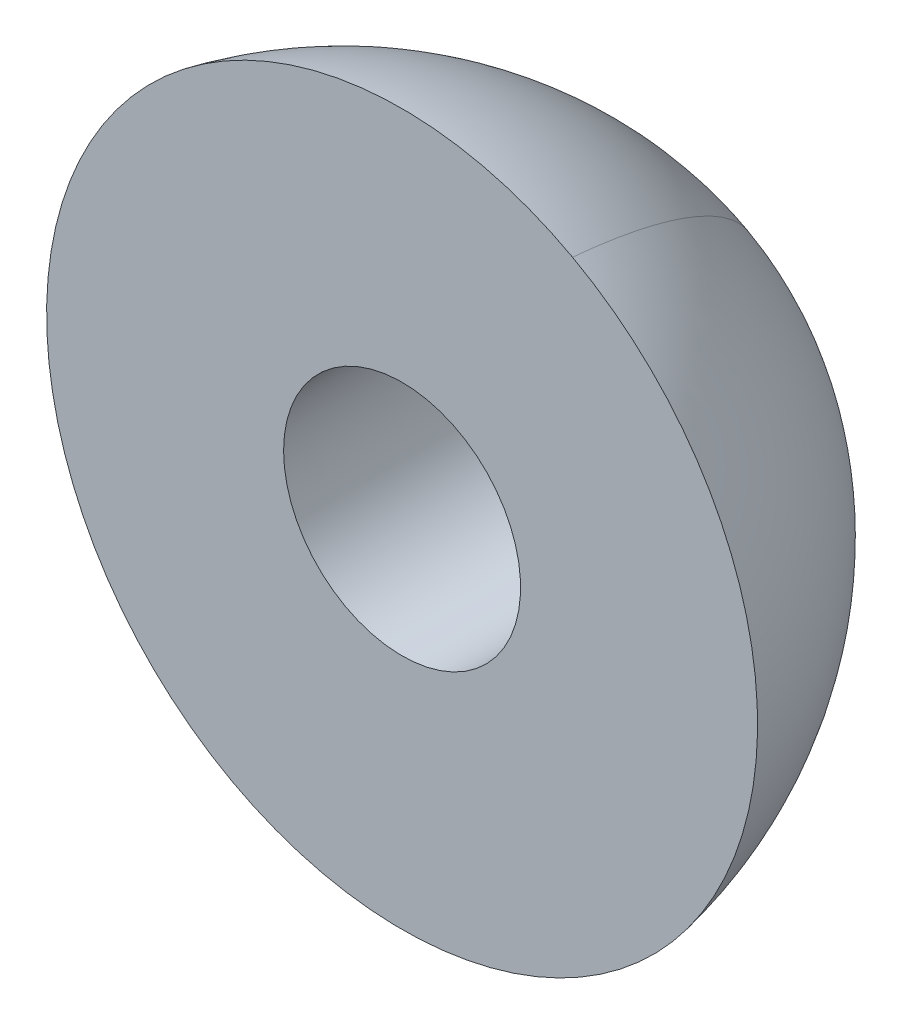
ISO-10303-21;
HEADER;
FILE_DESCRIPTION(('STEP AP214'),'2;1');
FILE_NAME('part.step','',(''),(''),'','','');
FILE_SCHEMA(('AUTOMOTIVE_DESIGN { 1 0 10303 214 1 1 1 1 }'));
ENDSEC;
DATA;
#1=APPLICATION_CONTEXT('core data for automotive mechanical design processes');
#2=APPLICATION_PROTOCOL_DEFINITION('international standard','automotive_design',2000,#1);
#3=PRODUCT_CONTEXT('',#1,'mechanical');
#4=PRODUCT('Part','Part','',(#3));
#5=PRODUCT_RELATED_PRODUCT_CATEGORY('part','',(#4));
#6=PRODUCT_DEFINITION_FORMATION('','',#4);
#7=PRODUCT_DEFINITION_CONTEXT('part definition',#1,'design');
#8=PRODUCT_DEFINITION('design','',#6,#7);
#9=PRODUCT_DEFINITION_SHAPE('','',#8);
#10=(LENGTH_UNIT() NAMED_UNIT(*) SI_UNIT(.MILLI.,.METRE.));
#11=(NAMED_UNIT(*) PLANE_ANGLE_UNIT() SI_UNIT($,.RADIAN.));
#12=(NAMED_UNIT(*) SI_UNIT($,.STERADIAN.) SOLID_ANGLE_UNIT());
#13=UNCERTAINTY_MEASURE_WITH_UNIT(LENGTH_MEASURE(1.E-05),#10,'distance_accuracy_value','');
#14=(GEOMETRIC_REPRESENTATION_CONTEXT(3) GLOBAL_UNCERTAINTY_ASSIGNED_CONTEXT((#13)) GLOBAL_UNIT_ASSIGNED_CONTEXT((#10,
#11,#12)) REPRESENTATION_CONTEXT('',''));
#15=CARTESIAN_POINT('',(0.,0.,0.));
#16=DIRECTION('',(0.,0.,1.));
#17=DIRECTION('',(1.,0.,0.));
#18=AXIS2_PLACEMENT_3D('',#15,#16,#17);
#19=CARTESIAN_POINT('',(10.4126553286348,-3.6734504658553,-7.02));
#20=CARTESIAN_POINT('',(10.2782051560537,-3.6,-7.02));
#21=CARTESIAN_POINT('',(10.125,-3.6,-7.02));
#22=CARTESIAN_POINT('',(9.525,-3.6,-7.02));
#23=CARTESIAN_POINT('',(9.525,-4.2,-7.02));
#24=CARTESIAN_POINT('',(9.525,-4.8,-7.02));
#25=CARTESIAN_POINT('',(10.125,-4.8,-7.02));
#26=CARTESIAN_POINT('',(10.725,-4.8,-7.02));
#27=CARTESIAN_POINT('',(10.725,-4.2,-7.02));
#28=CARTESIAN_POINT('',(10.725,-3.84408514172645,-7.02));
#29=CARTESIAN_POINT('',(10.4126553286348,-3.6734504658553,-7.02));
#30=CARTESIAN_POINT('',(10.3968421163721,-3.70239635602794,-7.18295627713));
#31=CARTESIAN_POINT('',(10.2697830431594,-3.63298366626,-7.18295627713));
#32=CARTESIAN_POINT('',(10.125,-3.63298366626,-7.18295627713));
#33=CARTESIAN_POINT('',(9.55798366626,-3.63298366626,-7.18295627713));
#34=CARTESIAN_POINT('',(9.55798366626,-4.2,-7.18295627713));
#35=CARTESIAN_POINT('',(9.55798366626,-4.76701633374,-7.18295627713));
#36=CARTESIAN_POINT('',(10.125,-4.76701633374,-7.18295627713));
#37=CARTESIAN_POINT('',(10.69201633374,-4.76701633374,-7.18295627713));
#38=CARTESIAN_POINT('',(10.69201633374,-4.2,-7.18295627713));
#39=CARTESIAN_POINT('',(10.69201633374,-3.8636507698969,-7.18295627713));
#40=CARTESIAN_POINT('',(10.3968421163721,-3.70239635602794,-7.18295627713));
#41=CARTESIAN_POINT('',(10.3561867072784,-3.7768155813569,-7.33577286233));
#42=CARTESIAN_POINT('',(10.2481299824489,-3.71778392208,-7.33577286233));
#43=CARTESIAN_POINT('',(10.125,-3.71778392208,-7.33577286233));
#44=CARTESIAN_POINT('',(9.64278392208,-3.71778392208,-7.33577286233));
#45=CARTESIAN_POINT('',(9.64278392208,-4.2,-7.33577286233));
#46=CARTESIAN_POINT('',(9.64278392208,-4.68221607792,-7.33577286233));
#47=CARTESIAN_POINT('',(10.125,-4.68221607792,-7.33577286233));
#48=CARTESIAN_POINT('',(10.60721607792,-4.68221607792,-7.33577286233));
#49=CARTESIAN_POINT('',(10.60721607792,-4.2,-7.33577286233));
#50=CARTESIAN_POINT('',(10.60721607792,-3.91395355494979,-7.33577286233));
#51=CARTESIAN_POINT('',(10.3561867072784,-3.7768155813569,-7.33577286233));
#52=CARTESIAN_POINT('',(10.2936338214068,-3.89131786807427,-7.45204992331));
#53=CARTESIAN_POINT('',(10.2148143310857,-3.8482585832,-7.45204992331));
#54=CARTESIAN_POINT('',(10.125,-3.8482585832,-7.45204992331));
#55=CARTESIAN_POINT('',(9.7732585832,-3.8482585832,-7.45204992331));
#56=CARTESIAN_POINT('',(9.7732585832,-4.2,-7.45204992331));
#57=CARTESIAN_POINT('',(9.7732585832,-4.5517414168,-7.45204992331));
#58=CARTESIAN_POINT('',(10.125,-4.5517414168,-7.45204992331));
#59=CARTESIAN_POINT('',(10.4767414168,-4.5517414168,-7.45204992331));
#60=CARTESIAN_POINT('',(10.4767414168,-4.2,-7.45204992331));
#61=CARTESIAN_POINT('',(10.4767414168,-3.99135000581782,-7.45204992331));
#62=CARTESIAN_POINT('',(10.2936338214068,-3.89131786807427,-7.45204992331));
#63=CARTESIAN_POINT('',(10.2208851095449,-4.02448348861843,-7.52));
#64=CARTESIAN_POINT('',(10.1760683853512,-4.,-7.52));
#65=CARTESIAN_POINT('',(10.125,-4.,-7.52));
#66=CARTESIAN_POINT('',(9.925,-4.,-7.52));
#67=CARTESIAN_POINT('',(9.925,-4.2,-7.52));
#68=CARTESIAN_POINT('',(9.925,-4.4,-7.52));
#69=CARTESIAN_POINT('',(10.125,-4.4,-7.52));
#70=CARTESIAN_POINT('',(10.325,-4.4,-7.52));
#71=CARTESIAN_POINT('',(10.325,-4.2,-7.52));
#72=CARTESIAN_POINT('',(10.325,-4.08136171390882,-7.52));
#73=CARTESIAN_POINT('',(10.2208851095449,-4.02448348861843,-7.52));
#74=(BOUNDED_SURFACE() B_SPLINE_SURFACE(4,2,((#19,#20,#21,#22,#23,#24,#25,#26,#27,#28,#29),(#30,
#31,#32,#33,#34,#35,#36,#37,#38,#39,#40),(#41,#42,#43,#44,#45,#46,#47,#48,#49,#50,#51),(#52,#53,
#54,#55,#56,#57,#58,#59,#60,#61,#62),(#63,#64,#65,#66,#67,#68,#69,#70,#71,#72,#73)),
.UNSPECIFIED.,.F.,.T.,.F.) B_SPLINE_SURFACE_WITH_KNOTS((5,5),(3,2,2,2,2,3),(3.59338935395,
4.25843275699),(5.77021321436567,6.28318530717959,7.85398163397448,9.42477796076938,
10.9955742875643,12.0533985215453),
.UNSPECIFIED.) GEOMETRIC_REPRESENTATION_ITEM() RATIONAL_B_SPLINE_SURFACE(((0.871173024921435,
0.904350395488696,1.,0.707106781186548,1.,0.707106781186548,1.,0.707106781186548,1.,
0.802756385697852,0.871173024921435),(0.871173024921435,0.904350395488696,1.,0.707106781186548,
1.,0.707106781186548,1.,0.707106781186548,1.,0.802756385697852,0.871173024921435),
(0.871173024921435,0.904350395488696,1.,0.707106781186548,1.,0.707106781186548,1.,
0.707106781186548,1.,0.802756385697852,0.871173024921435),(0.871173024921435,0.904350395488696,
1.,0.707106781186548,1.,0.707106781186548,1.,0.707106781186548,1.,0.802756385697852,
0.871173024921435),(0.871173024921435,0.904350395488696,1.,0.707106781186548,1.,
0.707106781186548,1.,0.707106781186548,1.,0.802756385697852,0.871173024921435))) REPRESENTATION_ITEM('') SURFACE());
#75=CARTESIAN_POINT('',(10.125,-4.20000000000004,-7.02));
#76=DIRECTION('',(0.,0.,1.));
#77=DIRECTION('',(0.,-1.,0.));
#78=AXIS2_PLACEMENT_3D('',#75,#76,#77);
#79=CIRCLE('',#78,0.600000000000035);
#80=CARTESIAN_POINT('',(10.4126553249935,-3.67345046386605,-7.02));
#81=VERTEX_POINT('',#80);
#82=CARTESIAN_POINT('',(9.83734467686956,-4.72654953715179,-7.02));
#83=VERTEX_POINT('',#82);
#84=EDGE_CURVE('E53',#81,#83,#79,.T.);
#85=CARTESIAN_POINT('',(10.4126553286348,-3.6734504658553,-7.02));
#86=CARTESIAN_POINT('',(10.4126546714423,-3.67345166883811,-7.02000677241555));
#87=CARTESIAN_POINT('',(10.4126540142016,-3.67345287190903,-7.02001354481014));
#88=CARTESIAN_POINT('',(10.4126515357505,-3.67345740868335,-7.0200390815261));
#89=CARTESIAN_POINT('',(10.4126497142183,-3.67346074297559,-7.02005784571004));
#90=CARTESIAN_POINT('',(10.4113540444705,-3.67583245048016,-7.03340212923775));
#91=CARTESIAN_POINT('',(10.4098731480153,-3.67854321318971,-7.046652079446));
#92=CARTESIAN_POINT('',(10.4065963993501,-3.68454126123696,-7.07253348135453));
#93=CARTESIAN_POINT('',(10.4048119341682,-3.68780770276002,-7.0851712703465));
#94=CARTESIAN_POINT('',(10.4009681017861,-3.69484379056307,-7.10980801437561));
#95=CARTESIAN_POINT('',(10.3989196245227,-3.69859350294789,-7.12181434939736));
#96=CARTESIAN_POINT('',(10.3945866128719,-3.70652502737428,-7.14517353203786));
#97=CARTESIAN_POINT('',(10.3923124262105,-3.7106878980308,-7.15653473881593));
#98=CARTESIAN_POINT('',(10.3875628712888,-3.71938189978167,-7.17860772478805));
#99=CARTESIAN_POINT('',(10.3850970343758,-3.72389558386218,-7.18932842911336));
#100=CARTESIAN_POINT('',(10.3800014690533,-3.73322295338798,-7.21010876035014));
#101=CARTESIAN_POINT('',(10.3773809768876,-3.73801973200281,-7.22017824477182));
#102=CARTESIAN_POINT('',(10.3720096612669,-3.74785185905168,-7.23966193501533));
#103=CARTESIAN_POINT('',(10.3692674945066,-3.7528713615126,-7.24908652721603));
#104=CARTESIAN_POINT('',(10.3636844419004,-3.76309107050444,-7.26729107995362));
#105=CARTESIAN_POINT('',(10.3608516383713,-3.76827648245381,-7.27608182820511));
#106=CARTESIAN_POINT('',(10.3551169381508,-3.77877378053503,-7.29303343967462));
#107=CARTESIAN_POINT('',(10.3522225605524,-3.78407190305976,-7.30120537326532));
#108=CARTESIAN_POINT('',(10.3463923406333,-3.79474404877239,-7.31693749622664));
#109=CARTESIAN_POINT('',(10.3434634697971,-3.80010531074391,-7.32450892954108));
#110=CARTESIAN_POINT('',(10.3375899036053,-3.81085680127484,-7.33906094951341));
#111=CARTESIAN_POINT('',(10.3346516510592,-3.81623523635095,-7.34605285358377));
#112=CARTESIAN_POINT('',(10.3287830036748,-3.82697772306581,-7.35946888546512));
#113=CARTESIAN_POINT('',(10.3258585441619,-3.8323309101646,-7.365904312711));
#114=CARTESIAN_POINT('',(10.3200392466285,-3.84298306258558,-7.37823211437944));
#115=CARTESIAN_POINT('',(10.3171498594493,-3.84827205020985,-7.38413568643226));
#116=CARTESIAN_POINT('',(10.311420629299,-3.85875933539622,-7.39542565037652));
#117=CARTESIAN_POINT('',(10.3085857757249,-3.8639484999285,-7.40082306296864));
#118=CARTESIAN_POINT('',(10.3029836999076,-3.87420303067542,-7.41112739067044));
#119=CARTESIAN_POINT('',(10.3002210324558,-3.87926005940045,-7.41604507659294));
#120=CARTESIAN_POINT('',(10.2947798822297,-3.88922001783596,-7.42541674066087));
#121=CARTESIAN_POINT('',(10.292105534539,-3.89411537832684,-7.42988119022375));
#122=CARTESIAN_POINT('',(10.2844754708097,-3.90808211595525,-7.4422237993007));
#123=CARTESIAN_POINT('',(10.2794452124535,-3.9172899418869,-7.44990311531928));
#124=CARTESIAN_POINT('',(10.2698682024363,-3.93482054070285,-7.46368693864904));
#125=CARTESIAN_POINT('',(10.2653457635717,-3.94309880931321,-7.46986525290199));
#126=CARTESIAN_POINT('',(10.2568654757556,-3.95862187165582,-7.48084990238066));
#127=CARTESIAN_POINT('',(10.2529270702572,-3.96583107438646,-7.48572154758932));
#128=CARTESIAN_POINT('',(10.2456780953182,-3.97910023368186,-7.49427518507073));
#129=CARTESIAN_POINT('',(10.2423826384503,-3.9851325268683,-7.49801310225865));
#130=CARTESIAN_POINT('',(10.234608225735,-3.99936349353771,-7.50648204166408));
#131=CARTESIAN_POINT('',(10.2301060966111,-4.00760458541722,-7.51112116544221));
#132=CARTESIAN_POINT('',(10.2240049166131,-4.01877272022214,-7.51705596370181));
#133=CARTESIAN_POINT('',(10.2224476620196,-4.02162325556676,-7.51854052958648));
#134=CARTESIAN_POINT('',(10.2208851095449,-4.02448348861843,-7.52));
#135=B_SPLINE_CURVE_WITH_KNOTS('',3,(#85,#86,#87,#88,#89,#90,#91,#92,#93,#94,#95,#96,#97,#98,
#99,#100,#101,#102,#103,#104,#105,#106,#107,#108,#109,#110,#111,#112,#113,#114,#115,#116,#117,
#118,#119,#120,#121,#122,#123,#124,#125,#126,#127,#128,#129,#130,#131,#132,#133,#134),
.UNSPECIFIED.,.F.,.F.,(4,2,2,2,2,2,2,2,2,2,2,2,2,2,2,2,2,2,2,2,2,2,2,2,4),(0.,
2.07292565339587E-05,7.81641911860983E-05,0.0408663197291154,0.0803699978280657,
0.118582659256838,0.155500802421267,0.19115728109239,0.225515504908005,0.258576462533591,
0.290341556495688,0.320812275897041,0.349989976833831,0.377875751856306,0.404470369623662,
0.429774266939325,0.453787577189301,0.476510181500029,0.497941771413769,0.536926346243527,
0.570742485200193,0.599386408902901,0.622855679269584,0.654265717165696,0.664979279515406),.UNSPECIFIED.);
#136=CARTESIAN_POINT('',(10.2208851081642,-4.02448348786415,-7.52));
#137=VERTEX_POINT('',#136);
#138=EDGE_CURVE('E42',#81,#137,#135,.T.);
#139=CARTESIAN_POINT('',(10.125,-4.20000000000002,-7.52));
#140=DIRECTION('',(0.,0.,-1.));
#141=DIRECTION('',(-1.,0.,0.));
#142=AXIS2_PLACEMENT_3D('',#139,#140,#141);
#143=CIRCLE('',#142,0.2);
#144=CARTESIAN_POINT('',(10.0291148922876,-4.37551651238268,-7.52));
#145=VERTEX_POINT('',#144);
#146=EDGE_CURVE('E51',#145,#137,#143,.T.);
#147=CARTESIAN_POINT('',(9.83734467688806,-4.72654953716186,-7.02));
#148=CARTESIAN_POINT('',(9.85315788884712,-4.69760364682335,-7.18295627713));
#149=CARTESIAN_POINT('',(9.89381329716025,-4.62318442106797,-7.33577286233));
#150=CARTESIAN_POINT('',(9.95636618183091,-4.50868213369449,-7.45204992331));
#151=CARTESIAN_POINT('',(10.029114892296,-4.37551651238729,-7.52));
#152=B_SPLINE_CURVE_WITH_KNOTS('',4,(#147,#148,#149,#150,#151),.UNSPECIFIED.,.F.,.F.,(5,5),
(3.59338935395,4.25843275699),.UNSPECIFIED.);
#153=EDGE_CURVE('E35',#145,#83,#152,.F.);
#154=ORIENTED_EDGE('',*,*,#84,.F.);
#155=ORIENTED_EDGE('',*,*,#138,.T.);
#156=ORIENTED_EDGE('',*,*,#146,.F.);
#157=ORIENTED_EDGE('',*,*,#153,.T.);
#158=EDGE_LOOP('',(#154,#155,#156,#157));
#159=FACE_BOUND('',#158,.T.);
#160=ADVANCED_FACE('F17',(#159),#74,.T.);
#161=CARTESIAN_POINT('',(10.125,-4.20000000000002,-7.02));
#162=DIRECTION('',(0.,0.,-1.));
#163=DIRECTION('',(-1.,0.,0.));
#164=AXIS2_PLACEMENT_3D('',#161,#162,#163);
#165=CYLINDRICAL_SURFACE('',#164,0.2);
#166=CARTESIAN_POINT('',(10.125,-4.2,-7.52));
#167=DIRECTION('',(0.,0.,1.));
#168=DIRECTION('',(1.,0.,0.));
#169=AXIS2_PLACEMENT_3D('',#166,#167,#168);
#170=CIRCLE('',#169,0.2);
#171=EDGE_CURVE('E27',#145,#137,#170,.T.);
#172=ORIENTED_EDGE('',*,*,#171,.F.);
#173=ORIENTED_EDGE('',*,*,#146,.T.);
#174=EDGE_LOOP('',(#172,#173));
#175=FACE_BOUND('',#174,.T.);
#176=CARTESIAN_POINT('',(10.125,-4.20000000000002,-7.02));
#177=DIRECTION('',(0.,0.,-1.));
#178=DIRECTION('',(-1.,0.,0.));
#179=AXIS2_PLACEMENT_3D('',#176,#177,#178);
#180=CIRCLE('',#179,0.2);
#181=CARTESIAN_POINT('',(9.92500000000002,-4.20000000000002,-7.02));
#182=VERTEX_POINT('',#181);
#183=EDGE_CURVE('E57',#182,#182,#180,.T.);
#184=ORIENTED_EDGE('',*,*,#183,.F.);
#185=EDGE_LOOP('',(#184));
#186=FACE_BOUND('',#185,.T.);
#187=ADVANCED_FACE('F55',(#175,#186),#165,.F.);
#188=CARTESIAN_POINT('',(10.9402048602931,-3.38479513967979,-7.02));
#189=DIRECTION('',(0.,0.,1.));
#190=DIRECTION('',(-1.,0.,0.));
#191=AXIS2_PLACEMENT_3D('',#188,#189,#190);
#192=PLANE('',#191);
#193=ORIENTED_EDGE('',*,*,#183,.T.);
#194=EDGE_LOOP('',(#193));
#195=FACE_BOUND('',#194,.T.);
#196=CARTESIAN_POINT('',(10.125,-4.2,-7.02));
#197=DIRECTION('',(0.,0.,1.));
#198=DIRECTION('',(1.,0.,0.));
#199=AXIS2_PLACEMENT_3D('',#196,#197,#198);
#200=CIRCLE('',#199,0.6);
#201=EDGE_CURVE('E11',#81,#83,#200,.F.);
#202=ORIENTED_EDGE('',*,*,#201,.F.);
#203=ORIENTED_EDGE('',*,*,#84,.T.);
#204=EDGE_LOOP('',(#202,#203));
#205=FACE_BOUND('',#204,.T.);
#206=ADVANCED_FACE('F19',(#195,#205),#192,.T.);
#207=CARTESIAN_POINT('',(10.125,-3.6,-7.02));
#208=CARTESIAN_POINT('',(9.525,-3.6,-7.02));
#209=CARTESIAN_POINT('',(9.525,-4.2,-7.02));
#210=CARTESIAN_POINT('',(9.525,-4.8,-7.02));
#211=CARTESIAN_POINT('',(10.125,-4.8,-7.02));
#212=CARTESIAN_POINT('',(10.725,-4.8,-7.02));
#213=CARTESIAN_POINT('',(10.725,-4.2,-7.02));
#214=CARTESIAN_POINT('',(10.725,-3.6,-7.02));
#215=CARTESIAN_POINT('',(10.125,-3.6,-7.02));
#216=CARTESIAN_POINT('',(10.125,-3.63298366626,-7.18295627713));
#217=CARTESIAN_POINT('',(9.55798366626,-3.63298366626,-7.18295627713));
#218=CARTESIAN_POINT('',(9.55798366626,-4.2,-7.18295627713));
#219=CARTESIAN_POINT('',(9.55798366626,-4.76701633374,-7.18295627713));
#220=CARTESIAN_POINT('',(10.125,-4.76701633374,-7.18295627713));
#221=CARTESIAN_POINT('',(10.69201633374,-4.76701633374,-7.18295627713));
#222=CARTESIAN_POINT('',(10.69201633374,-4.2,-7.18295627713));
#223=CARTESIAN_POINT('',(10.69201633374,-3.63298366626,-7.18295627713));
#224=CARTESIAN_POINT('',(10.125,-3.63298366626,-7.18295627713));
#225=CARTESIAN_POINT('',(10.125,-3.71778392208,-7.33577286233));
#226=CARTESIAN_POINT('',(9.64278392208,-3.71778392208,-7.33577286233));
#227=CARTESIAN_POINT('',(9.64278392208,-4.2,-7.33577286233));
#228=CARTESIAN_POINT('',(9.64278392208,-4.68221607792,-7.33577286233));
#229=CARTESIAN_POINT('',(10.125,-4.68221607792,-7.33577286233));
#230=CARTESIAN_POINT('',(10.60721607792,-4.68221607792,-7.33577286233));
#231=CARTESIAN_POINT('',(10.60721607792,-4.2,-7.33577286233));
#232=CARTESIAN_POINT('',(10.60721607792,-3.71778392208,-7.33577286233));
#233=CARTESIAN_POINT('',(10.125,-3.71778392208,-7.33577286233));
#234=CARTESIAN_POINT('',(10.125,-3.8482585832,-7.45204992331));
#235=CARTESIAN_POINT('',(9.7732585832,-3.8482585832,-7.45204992331));
#236=CARTESIAN_POINT('',(9.7732585832,-4.2,-7.45204992331));
#237=CARTESIAN_POINT('',(9.7732585832,-4.5517414168,-7.45204992331));
#238=CARTESIAN_POINT('',(10.125,-4.5517414168,-7.45204992331));
#239=CARTESIAN_POINT('',(10.4767414168,-4.5517414168,-7.45204992331));
#240=CARTESIAN_POINT('',(10.4767414168,-4.2,-7.45204992331));
#241=CARTESIAN_POINT('',(10.4767414168,-3.8482585832,-7.45204992331));
#242=CARTESIAN_POINT('',(10.125,-3.8482585832,-7.45204992331));
#243=CARTESIAN_POINT('',(10.125,-4.,-7.52));
#244=CARTESIAN_POINT('',(9.925,-4.,-7.52));
#245=CARTESIAN_POINT('',(9.925,-4.2,-7.52));
#246=CARTESIAN_POINT('',(9.925,-4.4,-7.52));
#247=CARTESIAN_POINT('',(10.125,-4.4,-7.52));
#248=CARTESIAN_POINT('',(10.325,-4.4,-7.52));
#249=CARTESIAN_POINT('',(10.325,-4.2,-7.52));
#250=CARTESIAN_POINT('',(10.325,-4.,-7.52));
#251=CARTESIAN_POINT('',(10.125,-4.,-7.52));
#252=(BOUNDED_SURFACE() B_SPLINE_SURFACE(4,2,((#207,#208,#209,#210,#211,#212,#213,#214,#215),
(#216,#217,#218,#219,#220,#221,#222,#223,#224),(#225,#226,#227,#228,#229,#230,#231,#232,#233),
(#234,#235,#236,#237,#238,#239,#240,#241,#242),(#243,#244,#245,#246,#247,#248,#249,#250,#251)),
.UNSPECIFIED.,.F.,.T.,.F.) B_SPLINE_SURFACE_WITH_KNOTS((5,5),(3,2,2,2,3),(3.59338935395,
4.25843275699),(0.,1.5707963267949,3.14159265358979,4.71238898038469,6.28318530717959),
.UNSPECIFIED.) GEOMETRIC_REPRESENTATION_ITEM() RATIONAL_B_SPLINE_SURFACE(((1.,0.707106781186548,
1.,0.707106781186548,1.,0.707106781186548,1.,0.707106781186548,1.),(1.,0.707106781186548,1.,
0.707106781186548,1.,0.707106781186548,1.,0.707106781186548,1.),(1.,0.707106781186548,1.,
0.707106781186548,1.,0.707106781186548,1.,0.707106781186548,1.),(1.,0.707106781186548,1.,
0.707106781186548,1.,0.707106781186548,1.,0.707106781186548,1.),(1.,0.707106781186548,1.,
0.707106781186548,1.,0.707106781186548,1.,0.707106781186548,1.))) REPRESENTATION_ITEM('') SURFACE());
#253=ORIENTED_EDGE('',*,*,#201,.T.);
#254=ORIENTED_EDGE('',*,*,#153,.F.);
#255=ORIENTED_EDGE('',*,*,#171,.T.);
#256=ORIENTED_EDGE('',*,*,#138,.F.);
#257=EDGE_LOOP('',(#253,#254,#255,#256));
#258=FACE_BOUND('',#257,.T.);
#259=ADVANCED_FACE('F47',(#258),#252,.T.);
#260=CLOSED_SHELL('',(#160,#187,#206,#259));
#261=MANIFOLD_SOLID_BREP('B1',#260);
#262=ADVANCED_BREP_SHAPE_REPRESENTATION('',(#18,#261),#14);
#263=SHAPE_DEFINITION_REPRESENTATION(#9,#262);
ENDSEC;
END-ISO-10303-21;
